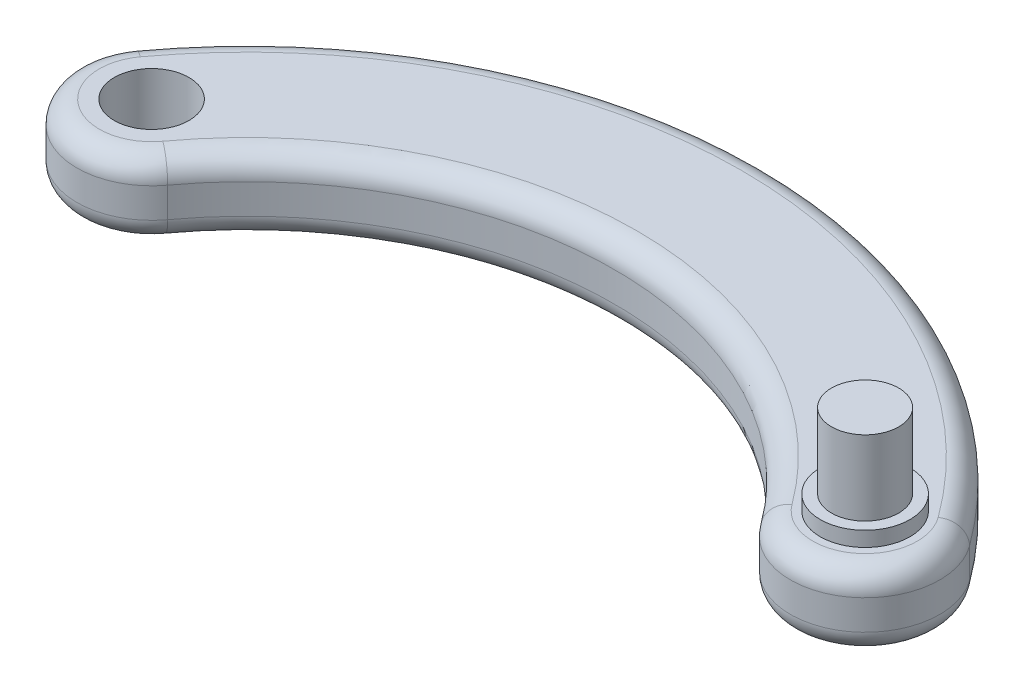
ISO-10303-21;
HEADER;
FILE_DESCRIPTION(('STEP AP214'),'2;1');
FILE_NAME('part.step','',(''),(''),'','','');
FILE_SCHEMA(('AUTOMOTIVE_DESIGN { 1 0 10303 214 1 1 1 1 }'));
ENDSEC;
DATA;
#1=APPLICATION_CONTEXT('core data for automotive mechanical design processes');
#2=APPLICATION_PROTOCOL_DEFINITION('international standard','automotive_design',2000,#1);
#3=PRODUCT_CONTEXT('',#1,'mechanical');
#4=PRODUCT('Part','Part','',(#3));
#5=PRODUCT_RELATED_PRODUCT_CATEGORY('part','',(#4));
#6=PRODUCT_DEFINITION_FORMATION('','',#4);
#7=PRODUCT_DEFINITION_CONTEXT('part definition',#1,'design');
#8=PRODUCT_DEFINITION('design','',#6,#7);
#9=PRODUCT_DEFINITION_SHAPE('','',#8);
#10=(LENGTH_UNIT() NAMED_UNIT(*) SI_UNIT(.MILLI.,.METRE.));
#11=(NAMED_UNIT(*) PLANE_ANGLE_UNIT() SI_UNIT($,.RADIAN.));
#12=(NAMED_UNIT(*) SI_UNIT($,.STERADIAN.) SOLID_ANGLE_UNIT());
#13=UNCERTAINTY_MEASURE_WITH_UNIT(LENGTH_MEASURE(1.E-05),#10,'distance_accuracy_value','');
#14=(GEOMETRIC_REPRESENTATION_CONTEXT(3) GLOBAL_UNCERTAINTY_ASSIGNED_CONTEXT((#13)) GLOBAL_UNIT_ASSIGNED_CONTEXT((#10,
#11,#12)) REPRESENTATION_CONTEXT('',''));
#15=CARTESIAN_POINT('',(0.,0.,0.));
#16=DIRECTION('',(0.,0.,1.));
#17=DIRECTION('',(1.,0.,0.));
#18=AXIS2_PLACEMENT_3D('',#15,#16,#17);
#19=CARTESIAN_POINT('',(0.,10.,0.));
#20=DIRECTION('',(0.,-1.,0.));
#21=DIRECTION('',(0.,0.,-1.));
#22=AXIS2_PLACEMENT_3D('',#19,#20,#21);
#23=CYLINDRICAL_SURFACE('',#22,10.);
#24=DIRECTION('',(0.,-1.,0.));
#25=VECTOR('',#24,1.);
#26=CARTESIAN_POINT('',(-8.06539223350706,10.,5.91180582560726));
#27=LINE('',#26,#25);
#28=CARTESIAN_POINT('',(-8.06539223350706,7.,5.91180582560726));
#29=VERTEX_POINT('',#28);
#30=CARTESIAN_POINT('',(-8.06539223350706,3.,5.91180582560726));
#31=VERTEX_POINT('',#30);
#32=EDGE_CURVE('E168',#29,#31,#27,.T.);
#33=ORIENTED_EDGE('',*,*,#32,.T.);
#34=CARTESIAN_POINT('',(0.,3.,0.));
#35=DIRECTION('',(0.,1.,0.));
#36=DIRECTION('',(0.,0.,1.));
#37=AXIS2_PLACEMENT_3D('',#34,#35,#36);
#38=CIRCLE('',#37,10.);
#39=CARTESIAN_POINT('',(8.06539223350705,3.,-5.91180582560727));
#40=VERTEX_POINT('',#39);
#41=EDGE_CURVE('E119',#31,#40,#38,.T.);
#42=ORIENTED_EDGE('',*,*,#41,.T.);
#43=DIRECTION('',(0.,-1.,0.));
#44=VECTOR('',#43,1.);
#45=CARTESIAN_POINT('',(8.06539223350705,10.,-5.91180582560727));
#46=LINE('',#45,#44);
#47=CARTESIAN_POINT('',(8.06539223350705,7.,-5.91180582560727));
#48=VERTEX_POINT('',#47);
#49=EDGE_CURVE('E102',#48,#40,#46,.T.);
#50=ORIENTED_EDGE('',*,*,#49,.F.);
#51=CARTESIAN_POINT('',(0.,7.,0.));
#52=DIRECTION('',(0.,1.,0.));
#53=DIRECTION('',(0.,0.,1.));
#54=AXIS2_PLACEMENT_3D('',#51,#52,#53);
#55=CIRCLE('',#54,10.);
#56=EDGE_CURVE('E116',#48,#29,#55,.F.);
#57=ORIENTED_EDGE('',*,*,#56,.T.);
#58=EDGE_LOOP('',(#33,#42,#50,#57));
#59=FACE_BOUND('',#58,.T.);
#60=ADVANCED_FACE('F33',(#59),#23,.T.);
#61=CARTESIAN_POINT('',(-47.75,10.,35.));
#62=DIRECTION('',(0.,-1.,0.));
#63=DIRECTION('',(0.,0.,-1.));
#64=AXIS2_PLACEMENT_3D('',#61,#62,#63);
#65=CYLINDRICAL_SURFACE('',#64,69.2035683046216);
#66=ORIENTED_EDGE('',*,*,#49,.T.);
#67=CARTESIAN_POINT('',(-47.75,3.,35.));
#68=DIRECTION('',(0.,1.,0.));
#69=DIRECTION('',(0.,0.,1.));
#70=AXIS2_PLACEMENT_3D('',#67,#68,#69);
#71=CIRCLE('',#70,69.2035683046216);
#72=CARTESIAN_POINT('',(-103.565392233507,3.,-5.91180582560726));
#73=VERTEX_POINT('',#72);
#74=EDGE_CURVE('E11',#40,#73,#71,.T.);
#75=ORIENTED_EDGE('',*,*,#74,.T.);
#76=DIRECTION('',(0.,-1.,0.));
#77=VECTOR('',#76,1.);
#78=CARTESIAN_POINT('',(-103.565392233507,10.,-5.91180582560726));
#79=LINE('',#78,#77);
#80=CARTESIAN_POINT('',(-103.565392233507,7.,-5.91180582560726));
#81=VERTEX_POINT('',#80);
#82=EDGE_CURVE('E104',#81,#73,#79,.T.);
#83=ORIENTED_EDGE('',*,*,#82,.F.);
#84=CARTESIAN_POINT('',(-47.75,7.,35.));
#85=DIRECTION('',(0.,1.,0.));
#86=DIRECTION('',(0.,0.,1.));
#87=AXIS2_PLACEMENT_3D('',#84,#85,#86);
#88=CIRCLE('',#87,69.2035683046216);
#89=EDGE_CURVE('E42',#81,#48,#88,.F.);
#90=ORIENTED_EDGE('',*,*,#89,.T.);
#91=EDGE_LOOP('',(#66,#75,#83,#90));
#92=FACE_BOUND('',#91,.T.);
#93=ADVANCED_FACE('F101',(#92),#65,.T.);
#94=CARTESIAN_POINT('',(-95.5,10.,0.));
#95=DIRECTION('',(0.,-1.,0.));
#96=DIRECTION('',(0.,0.,-1.));
#97=AXIS2_PLACEMENT_3D('',#94,#95,#96);
#98=CYLINDRICAL_SURFACE('',#97,9.99999999999999);
#99=ORIENTED_EDGE('',*,*,#82,.T.);
#100=CARTESIAN_POINT('',(-95.5,3.,0.));
#101=DIRECTION('',(0.,1.,0.));
#102=DIRECTION('',(0.,0.,1.));
#103=AXIS2_PLACEMENT_3D('',#100,#101,#102);
#104=CIRCLE('',#103,9.99999999999999);
#105=CARTESIAN_POINT('',(-87.4346077664929,3.,5.91180582560727));
#106=VERTEX_POINT('',#105);
#107=EDGE_CURVE('E193',#73,#106,#104,.T.);
#108=ORIENTED_EDGE('',*,*,#107,.T.);
#109=DIRECTION('',(0.,-1.,0.));
#110=VECTOR('',#109,1.);
#111=CARTESIAN_POINT('',(-87.4346077664929,10.,5.91180582560727));
#112=LINE('',#111,#110);
#113=CARTESIAN_POINT('',(-87.4346077664929,7.,5.91180582560727));
#114=VERTEX_POINT('',#113);
#115=EDGE_CURVE('E173',#114,#106,#112,.T.);
#116=ORIENTED_EDGE('',*,*,#115,.F.);
#117=CARTESIAN_POINT('',(-95.5,7.,0.));
#118=DIRECTION('',(0.,1.,0.));
#119=DIRECTION('',(0.,0.,1.));
#120=AXIS2_PLACEMENT_3D('',#117,#118,#119);
#121=CIRCLE('',#120,9.99999999999999);
#122=EDGE_CURVE('E191',#114,#81,#121,.F.);
#123=ORIENTED_EDGE('',*,*,#122,.T.);
#124=EDGE_LOOP('',(#99,#108,#116,#123));
#125=FACE_BOUND('',#124,.T.);
#126=ADVANCED_FACE('F207',(#125),#98,.T.);
#127=CARTESIAN_POINT('',(-95.5,10.,0.));
#128=DIRECTION('',(0.,-1.,0.));
#129=DIRECTION('',(0.,0.,-1.));
#130=AXIS2_PLACEMENT_3D('',#127,#128,#129);
#131=CYLINDRICAL_SURFACE('',#130,5.);
#132=CARTESIAN_POINT('',(-95.5,10.,0.));
#133=DIRECTION('',(0.,1.,0.));
#134=DIRECTION('',(0.,0.,1.));
#135=AXIS2_PLACEMENT_3D('',#132,#133,#134);
#136=CIRCLE('',#135,5.);
#137=CARTESIAN_POINT('',(-95.5,10.,5.00000000000002));
#138=VERTEX_POINT('',#137);
#139=EDGE_CURVE('E163',#138,#138,#136,.T.);
#140=ORIENTED_EDGE('',*,*,#139,.T.);
#141=EDGE_LOOP('',(#140));
#142=FACE_BOUND('',#141,.T.);
#143=CARTESIAN_POINT('',(-95.5,0.,0.));
#144=DIRECTION('',(0.,1.,0.));
#145=DIRECTION('',(0.,0.,1.));
#146=AXIS2_PLACEMENT_3D('',#143,#144,#145);
#147=CIRCLE('',#146,5.);
#148=CARTESIAN_POINT('',(-95.5,0.,5.00000000000002));
#149=VERTEX_POINT('',#148);
#150=EDGE_CURVE('E157',#149,#149,#147,.T.);
#151=ORIENTED_EDGE('',*,*,#150,.F.);
#152=EDGE_LOOP('',(#151));
#153=FACE_BOUND('',#152,.T.);
#154=ADVANCED_FACE('F231',(#142,#153),#131,.F.);
#155=CARTESIAN_POINT('',(-47.75,10.,35.));
#156=DIRECTION('',(0.,-1.,0.));
#157=DIRECTION('',(0.,0.,-1.));
#158=AXIS2_PLACEMENT_3D('',#155,#156,#157);
#159=CYLINDRICAL_SURFACE('',#158,49.2035683046216);
#160=ORIENTED_EDGE('',*,*,#115,.T.);
#161=CARTESIAN_POINT('',(-47.75,3.,35.));
#162=DIRECTION('',(0.,1.,0.));
#163=DIRECTION('',(0.,0.,1.));
#164=AXIS2_PLACEMENT_3D('',#161,#162,#163);
#165=CIRCLE('',#164,49.2035683046216);
#166=EDGE_CURVE('E189',#106,#31,#165,.F.);
#167=ORIENTED_EDGE('',*,*,#166,.T.);
#168=ORIENTED_EDGE('',*,*,#32,.F.);
#169=CARTESIAN_POINT('',(-47.75,7.,35.));
#170=DIRECTION('',(0.,1.,0.));
#171=DIRECTION('',(0.,0.,1.));
#172=AXIS2_PLACEMENT_3D('',#169,#170,#171);
#173=CIRCLE('',#172,49.2035683046216);
#174=EDGE_CURVE('E187',#29,#114,#173,.T.);
#175=ORIENTED_EDGE('',*,*,#174,.T.);
#176=EDGE_LOOP('',(#160,#167,#168,#175));
#177=FACE_BOUND('',#176,.T.);
#178=ADVANCED_FACE('F205',(#177),#159,.F.);
#179=CARTESIAN_POINT('',(0.,10.,0.));
#180=DIRECTION('',(0.,1.,0.));
#181=DIRECTION('',(0.,0.,1.));
#182=AXIS2_PLACEMENT_3D('',#179,#180,#181);
#183=PLANE('',#182);
#184=CARTESIAN_POINT('',(0.,10.,0.));
#185=DIRECTION('',(0.,1.,0.));
#186=DIRECTION('',(0.,0.,1.));
#187=AXIS2_PLACEMENT_3D('',#184,#185,#186);
#188=CIRCLE('',#187,6.);
#189=CARTESIAN_POINT('',(0.,10.,6.));
#190=VERTEX_POINT('',#189);
#191=EDGE_CURVE('E136',#190,#190,#188,.T.);
#192=ORIENTED_EDGE('',*,*,#191,.F.);
#193=EDGE_LOOP('',(#192));
#194=FACE_BOUND('',#193,.T.);
#195=CARTESIAN_POINT('',(-47.75,10.,35.));
#196=DIRECTION('',(0.,1.,0.));
#197=DIRECTION('',(0.,0.,1.));
#198=AXIS2_PLACEMENT_3D('',#195,#196,#197);
#199=CIRCLE('',#198,52.2035683046216);
#200=CARTESIAN_POINT('',(-89.8542254365451,10.,4.13826407792509));
#201=VERTEX_POINT('',#200);
#202=CARTESIAN_POINT('',(-5.64577456345493,10.,4.13826407792508));
#203=VERTEX_POINT('',#202);
#204=EDGE_CURVE('E50',#201,#203,#199,.F.);
#205=ORIENTED_EDGE('',*,*,#204,.T.);
#206=CARTESIAN_POINT('',(0.,10.,0.));
#207=DIRECTION('',(0.,1.,0.));
#208=DIRECTION('',(0.,0.,1.));
#209=AXIS2_PLACEMENT_3D('',#206,#207,#208);
#210=CIRCLE('',#209,7.);
#211=CARTESIAN_POINT('',(5.64577456345494,10.,-4.13826407792509));
#212=VERTEX_POINT('',#211);
#213=EDGE_CURVE('E109',#203,#212,#210,.T.);
#214=ORIENTED_EDGE('',*,*,#213,.T.);
#215=CARTESIAN_POINT('',(-47.75,10.,35.));
#216=DIRECTION('',(0.,1.,0.));
#217=DIRECTION('',(0.,0.,1.));
#218=AXIS2_PLACEMENT_3D('',#215,#216,#217);
#219=CIRCLE('',#218,66.2035683046216);
#220=CARTESIAN_POINT('',(-101.145774563455,10.,-4.13826407792508));
#221=VERTEX_POINT('',#220);
#222=EDGE_CURVE('E130',#212,#221,#219,.T.);
#223=ORIENTED_EDGE('',*,*,#222,.T.);
#224=CARTESIAN_POINT('',(-95.5,10.,0.));
#225=DIRECTION('',(0.,1.,0.));
#226=DIRECTION('',(0.,0.,1.));
#227=AXIS2_PLACEMENT_3D('',#224,#225,#226);
#228=CIRCLE('',#227,6.99999999999999);
#229=EDGE_CURVE('E55',#221,#201,#228,.T.);
#230=ORIENTED_EDGE('',*,*,#229,.T.);
#231=EDGE_LOOP('',(#205,#214,#223,#230));
#232=FACE_BOUND('',#231,.T.);
#233=ORIENTED_EDGE('',*,*,#139,.F.);
#234=EDGE_LOOP('',(#233));
#235=FACE_BOUND('',#234,.T.);
#236=ADVANCED_FACE('F198',(#194,#232,#235),#183,.T.);
#237=CARTESIAN_POINT('',(0.,0.,0.));
#238=DIRECTION('',(0.,1.,0.));
#239=DIRECTION('',(0.,0.,1.));
#240=AXIS2_PLACEMENT_3D('',#237,#238,#239);
#241=PLANE('',#240);
#242=CARTESIAN_POINT('',(-47.75,0.,35.));
#243=DIRECTION('',(0.,1.,0.));
#244=DIRECTION('',(0.,0.,1.));
#245=AXIS2_PLACEMENT_3D('',#242,#243,#244);
#246=CIRCLE('',#245,66.2035683046216);
#247=CARTESIAN_POINT('',(-101.145774563455,0.,-4.13826407792507));
#248=VERTEX_POINT('',#247);
#249=CARTESIAN_POINT('',(5.64577456345494,0.,-4.13826407792509));
#250=VERTEX_POINT('',#249);
#251=EDGE_CURVE('E178',#248,#250,#246,.F.);
#252=ORIENTED_EDGE('',*,*,#251,.T.);
#253=CARTESIAN_POINT('',(0.,0.,0.));
#254=DIRECTION('',(0.,1.,0.));
#255=DIRECTION('',(0.,0.,1.));
#256=AXIS2_PLACEMENT_3D('',#253,#254,#255);
#257=CIRCLE('',#256,7.);
#258=CARTESIAN_POINT('',(-5.64577456345494,0.,4.13826407792508));
#259=VERTEX_POINT('',#258);
#260=EDGE_CURVE('E184',#250,#259,#257,.F.);
#261=ORIENTED_EDGE('',*,*,#260,.T.);
#262=CARTESIAN_POINT('',(-47.75,0.,35.));
#263=DIRECTION('',(0.,1.,0.));
#264=DIRECTION('',(0.,0.,1.));
#265=AXIS2_PLACEMENT_3D('',#262,#263,#264);
#266=CIRCLE('',#265,52.2035683046216);
#267=CARTESIAN_POINT('',(-89.8542254365451,0.,4.13826407792509));
#268=VERTEX_POINT('',#267);
#269=EDGE_CURVE('E182',#259,#268,#266,.T.);
#270=ORIENTED_EDGE('',*,*,#269,.T.);
#271=CARTESIAN_POINT('',(-95.5,0.,0.));
#272=DIRECTION('',(0.,1.,0.));
#273=DIRECTION('',(0.,0.,1.));
#274=AXIS2_PLACEMENT_3D('',#271,#272,#273);
#275=CIRCLE('',#274,6.99999999999999);
#276=EDGE_CURVE('E180',#268,#248,#275,.F.);
#277=ORIENTED_EDGE('',*,*,#276,.T.);
#278=EDGE_LOOP('',(#252,#261,#270,#277));
#279=FACE_BOUND('',#278,.T.);
#280=ORIENTED_EDGE('',*,*,#150,.T.);
#281=EDGE_LOOP('',(#280));
#282=FACE_BOUND('',#281,.T.);
#283=ADVANCED_FACE('F242',(#279,#282),#241,.F.);
#284=CARTESIAN_POINT('',(-95.5,3.,0.));
#285=DIRECTION('',(0.,1.,0.));
#286=DIRECTION('',(0.,0.,1.));
#287=AXIS2_PLACEMENT_3D('',#284,#285,#286);
#288=TOROIDAL_SURFACE('',#287,6.99999999999999,3.);
#289=CARTESIAN_POINT('',(-101.145774563455,3.,-4.13826407792507));
#290=DIRECTION('',(0.591180582560725,0.,-0.806539223350707));
#291=DIRECTION('',(-0.806539223350707,0.,-0.591180582560726));
#292=AXIS2_PLACEMENT_3D('',#289,#290,#291);
#293=CIRCLE('',#292,3.);
#294=EDGE_CURVE('E150',#248,#73,#293,.T.);
#295=ORIENTED_EDGE('',*,*,#294,.F.);
#296=ORIENTED_EDGE('',*,*,#276,.F.);
#297=CARTESIAN_POINT('',(-89.8542254365451,3.,4.13826407792509));
#298=DIRECTION('',(0.591180582560726,0.,-0.806539223350707));
#299=DIRECTION('',(-0.806539223350707,0.,-0.591180582560726));
#300=AXIS2_PLACEMENT_3D('',#297,#298,#299);
#301=CIRCLE('',#300,3.);
#302=EDGE_CURVE('E139',#106,#268,#301,.T.);
#303=ORIENTED_EDGE('',*,*,#302,.F.);
#304=ORIENTED_EDGE('',*,*,#107,.F.);
#305=EDGE_LOOP('',(#295,#296,#303,#304));
#306=FACE_BOUND('',#305,.T.);
#307=ADVANCED_FACE('F210',(#306),#288,.T.);
#308=CARTESIAN_POINT('',(-47.75,3.,35.));
#309=DIRECTION('',(0.,1.,0.));
#310=DIRECTION('',(0.,0.,1.));
#311=AXIS2_PLACEMENT_3D('',#308,#309,#310);
#312=TOROIDAL_SURFACE('',#311,52.2035683046216,3.);
#313=ORIENTED_EDGE('',*,*,#302,.T.);
#314=ORIENTED_EDGE('',*,*,#269,.F.);
#315=CARTESIAN_POINT('',(-5.64577456345494,3.,4.13826407792508));
#316=DIRECTION('',(0.591180582560727,0.,0.806539223350706));
#317=DIRECTION('',(0.806539223350706,0.,-0.591180582560727));
#318=AXIS2_PLACEMENT_3D('',#315,#316,#317);
#319=CIRCLE('',#318,3.);
#320=EDGE_CURVE('E144',#31,#259,#319,.T.);
#321=ORIENTED_EDGE('',*,*,#320,.F.);
#322=ORIENTED_EDGE('',*,*,#166,.F.);
#323=EDGE_LOOP('',(#313,#314,#321,#322));
#324=FACE_BOUND('',#323,.T.);
#325=ADVANCED_FACE('F213',(#324),#312,.T.);
#326=CARTESIAN_POINT('',(-47.75,3.,35.));
#327=DIRECTION('',(0.,1.,0.));
#328=DIRECTION('',(0.,0.,1.));
#329=AXIS2_PLACEMENT_3D('',#326,#327,#328);
#330=TOROIDAL_SURFACE('',#329,66.2035683046216,3.);
#331=ORIENTED_EDGE('',*,*,#294,.T.);
#332=ORIENTED_EDGE('',*,*,#74,.F.);
#333=CARTESIAN_POINT('',(5.64577456345494,3.,-4.13826407792509));
#334=DIRECTION('',(0.591180582560727,0.,0.806539223350705));
#335=DIRECTION('',(0.806539223350706,0.,-0.591180582560727));
#336=AXIS2_PLACEMENT_3D('',#333,#334,#335);
#337=CIRCLE('',#336,3.);
#338=EDGE_CURVE('E142',#250,#40,#337,.T.);
#339=ORIENTED_EDGE('',*,*,#338,.F.);
#340=ORIENTED_EDGE('',*,*,#251,.F.);
#341=EDGE_LOOP('',(#331,#332,#339,#340));
#342=FACE_BOUND('',#341,.T.);
#343=ADVANCED_FACE('F216',(#342),#330,.T.);
#344=CARTESIAN_POINT('',(0.,3.,0.));
#345=DIRECTION('',(0.,1.,0.));
#346=DIRECTION('',(0.,0.,1.));
#347=AXIS2_PLACEMENT_3D('',#344,#345,#346);
#348=TOROIDAL_SURFACE('',#347,7.,3.);
#349=ORIENTED_EDGE('',*,*,#320,.T.);
#350=ORIENTED_EDGE('',*,*,#260,.F.);
#351=ORIENTED_EDGE('',*,*,#338,.T.);
#352=ORIENTED_EDGE('',*,*,#41,.F.);
#353=EDGE_LOOP('',(#349,#350,#351,#352));
#354=FACE_BOUND('',#353,.T.);
#355=ADVANCED_FACE('F214',(#354),#348,.T.);
#356=CARTESIAN_POINT('',(-95.5,7.,0.));
#357=DIRECTION('',(0.,1.,0.));
#358=DIRECTION('',(0.,0.,1.));
#359=AXIS2_PLACEMENT_3D('',#356,#357,#358);
#360=TOROIDAL_SURFACE('',#359,6.99999999999999,3.);
#361=CARTESIAN_POINT('',(-101.145774563455,7.,-4.13826407792507));
#362=DIRECTION('',(0.591180582560726,0.,-0.806539223350706));
#363=DIRECTION('',(-0.806539223350706,0.,-0.591180582560726));
#364=AXIS2_PLACEMENT_3D('',#361,#362,#363);
#365=CIRCLE('',#364,3.);
#366=EDGE_CURVE('E133',#81,#221,#365,.T.);
#367=ORIENTED_EDGE('',*,*,#366,.F.);
#368=ORIENTED_EDGE('',*,*,#122,.F.);
#369=CARTESIAN_POINT('',(-89.8542254365451,7.,4.13826407792509));
#370=DIRECTION('',(0.591180582560725,0.,-0.806539223350707));
#371=DIRECTION('',(-0.806539223350707,0.,-0.591180582560725));
#372=AXIS2_PLACEMENT_3D('',#369,#370,#371);
#373=CIRCLE('',#372,3.);
#374=EDGE_CURVE('E37',#201,#114,#373,.T.);
#375=ORIENTED_EDGE('',*,*,#374,.F.);
#376=ORIENTED_EDGE('',*,*,#229,.F.);
#377=EDGE_LOOP('',(#367,#368,#375,#376));
#378=FACE_BOUND('',#377,.T.);
#379=ADVANCED_FACE('F35',(#378),#360,.T.);
#380=CARTESIAN_POINT('',(-47.75,7.,35.));
#381=DIRECTION('',(0.,1.,0.));
#382=DIRECTION('',(0.,0.,1.));
#383=AXIS2_PLACEMENT_3D('',#380,#381,#382);
#384=TOROIDAL_SURFACE('',#383,52.2035683046216,3.);
#385=ORIENTED_EDGE('',*,*,#374,.T.);
#386=ORIENTED_EDGE('',*,*,#174,.F.);
#387=CARTESIAN_POINT('',(-5.64577456345493,7.,4.13826407792508));
#388=DIRECTION('',(0.591180582560727,0.,0.806539223350706));
#389=DIRECTION('',(0.806539223350706,0.,-0.591180582560726));
#390=AXIS2_PLACEMENT_3D('',#387,#388,#389);
#391=CIRCLE('',#390,3.);
#392=EDGE_CURVE('E126',#203,#29,#391,.T.);
#393=ORIENTED_EDGE('',*,*,#392,.F.);
#394=ORIENTED_EDGE('',*,*,#204,.F.);
#395=EDGE_LOOP('',(#385,#386,#393,#394));
#396=FACE_BOUND('',#395,.T.);
#397=ADVANCED_FACE('F202',(#396),#384,.T.);
#398=CARTESIAN_POINT('',(-47.75,7.,35.));
#399=DIRECTION('',(0.,1.,0.));
#400=DIRECTION('',(0.,0.,1.));
#401=AXIS2_PLACEMENT_3D('',#398,#399,#400);
#402=TOROIDAL_SURFACE('',#401,66.2035683046216,3.);
#403=ORIENTED_EDGE('',*,*,#366,.T.);
#404=ORIENTED_EDGE('',*,*,#222,.F.);
#405=CARTESIAN_POINT('',(5.64577456345494,7.,-4.13826407792509));
#406=DIRECTION('',(0.591180582560727,0.,0.806539223350706));
#407=DIRECTION('',(0.806539223350706,0.,-0.591180582560727));
#408=AXIS2_PLACEMENT_3D('',#405,#406,#407);
#409=CIRCLE('',#408,3.);
#410=EDGE_CURVE('E124',#48,#212,#409,.T.);
#411=ORIENTED_EDGE('',*,*,#410,.F.);
#412=ORIENTED_EDGE('',*,*,#89,.F.);
#413=EDGE_LOOP('',(#403,#404,#411,#412));
#414=FACE_BOUND('',#413,.T.);
#415=ADVANCED_FACE('F129',(#414),#402,.T.);
#416=CARTESIAN_POINT('',(0.,7.,0.));
#417=DIRECTION('',(0.,1.,0.));
#418=DIRECTION('',(0.,0.,1.));
#419=AXIS2_PLACEMENT_3D('',#416,#417,#418);
#420=TOROIDAL_SURFACE('',#419,7.,3.);
#421=ORIENTED_EDGE('',*,*,#392,.T.);
#422=ORIENTED_EDGE('',*,*,#56,.F.);
#423=ORIENTED_EDGE('',*,*,#410,.T.);
#424=ORIENTED_EDGE('',*,*,#213,.F.);
#425=EDGE_LOOP('',(#421,#422,#423,#424));
#426=FACE_BOUND('',#425,.T.);
#427=ADVANCED_FACE('F122',(#426),#420,.T.);
#428=CARTESIAN_POINT('',(0.,12.,0.));
#429=DIRECTION('',(0.,1.,0.));
#430=DIRECTION('',(0.,0.,1.));
#431=AXIS2_PLACEMENT_3D('',#428,#429,#430);
#432=PLANE('',#431);
#433=CARTESIAN_POINT('',(0.,12.,0.));
#434=DIRECTION('',(0.,1.,0.));
#435=DIRECTION('',(0.,0.,1.));
#436=AXIS2_PLACEMENT_3D('',#433,#434,#435);
#437=CIRCLE('',#436,6.);
#438=CARTESIAN_POINT('',(0.,12.,6.));
#439=VERTEX_POINT('',#438);
#440=EDGE_CURVE('E131',#439,#439,#437,.T.);
#441=ORIENTED_EDGE('',*,*,#440,.T.);
#442=EDGE_LOOP('',(#441));
#443=FACE_BOUND('',#442,.T.);
#444=CARTESIAN_POINT('',(0.,12.,0.));
#445=DIRECTION('',(0.,1.,0.));
#446=DIRECTION('',(0.,0.,1.));
#447=AXIS2_PLACEMENT_3D('',#444,#445,#446);
#448=CIRCLE('',#447,4.5);
#449=CARTESIAN_POINT('',(0.,12.,4.5));
#450=VERTEX_POINT('',#449);
#451=EDGE_CURVE('E273',#450,#450,#448,.T.);
#452=ORIENTED_EDGE('',*,*,#451,.F.);
#453=EDGE_LOOP('',(#452));
#454=FACE_BOUND('',#453,.T.);
#455=ADVANCED_FACE('F256',(#443,#454),#432,.T.);
#456=CARTESIAN_POINT('',(0.,12.,0.));
#457=DIRECTION('',(0.,-1.,0.));
#458=DIRECTION('',(0.,0.,-1.));
#459=AXIS2_PLACEMENT_3D('',#456,#457,#458);
#460=CYLINDRICAL_SURFACE('',#459,6.);
#461=ORIENTED_EDGE('',*,*,#440,.F.);
#462=EDGE_LOOP('',(#461));
#463=FACE_BOUND('',#462,.T.);
#464=ORIENTED_EDGE('',*,*,#191,.T.);
#465=EDGE_LOOP('',(#464));
#466=FACE_BOUND('',#465,.T.);
#467=ADVANCED_FACE('F252',(#463,#466),#460,.T.);
#468=CARTESIAN_POINT('',(0.,22.,0.));
#469=DIRECTION('',(0.,-1.,0.));
#470=DIRECTION('',(0.,0.,-1.));
#471=AXIS2_PLACEMENT_3D('',#468,#469,#470);
#472=CYLINDRICAL_SURFACE('',#471,4.5);
#473=ORIENTED_EDGE('',*,*,#451,.T.);
#474=EDGE_LOOP('',(#473));
#475=FACE_BOUND('',#474,.T.);
#476=CARTESIAN_POINT('',(0.,22.,0.));
#477=DIRECTION('',(0.,1.,0.));
#478=DIRECTION('',(0.,0.,1.));
#479=AXIS2_PLACEMENT_3D('',#476,#477,#478);
#480=CIRCLE('',#479,4.5);
#481=CARTESIAN_POINT('',(0.,22.,4.5));
#482=VERTEX_POINT('',#481);
#483=EDGE_CURVE('E271',#482,#482,#480,.T.);
#484=ORIENTED_EDGE('',*,*,#483,.F.);
#485=EDGE_LOOP('',(#484));
#486=FACE_BOUND('',#485,.T.);
#487=ADVANCED_FACE('F255',(#475,#486),#472,.T.);
#488=CARTESIAN_POINT('',(0.,22.,0.));
#489=DIRECTION('',(0.,1.,0.));
#490=DIRECTION('',(0.,0.,1.));
#491=AXIS2_PLACEMENT_3D('',#488,#489,#490);
#492=PLANE('',#491);
#493=ORIENTED_EDGE('',*,*,#483,.T.);
#494=EDGE_LOOP('',(#493));
#495=FACE_BOUND('',#494,.T.);
#496=ADVANCED_FACE('F263',(#495),#492,.T.);
#497=CLOSED_SHELL('',(#60,#93,#126,#154,#178,#236,#283,#307,#325,#343,#355,#379,#397,#415,#427,
#455,#467,#487,#496));
#498=MANIFOLD_SOLID_BREP('B2',#497);
#499=ADVANCED_BREP_SHAPE_REPRESENTATION('',(#18,#498),#14);
#500=SHAPE_DEFINITION_REPRESENTATION(#9,#499);
ENDSEC;
END-ISO-10303-21;
